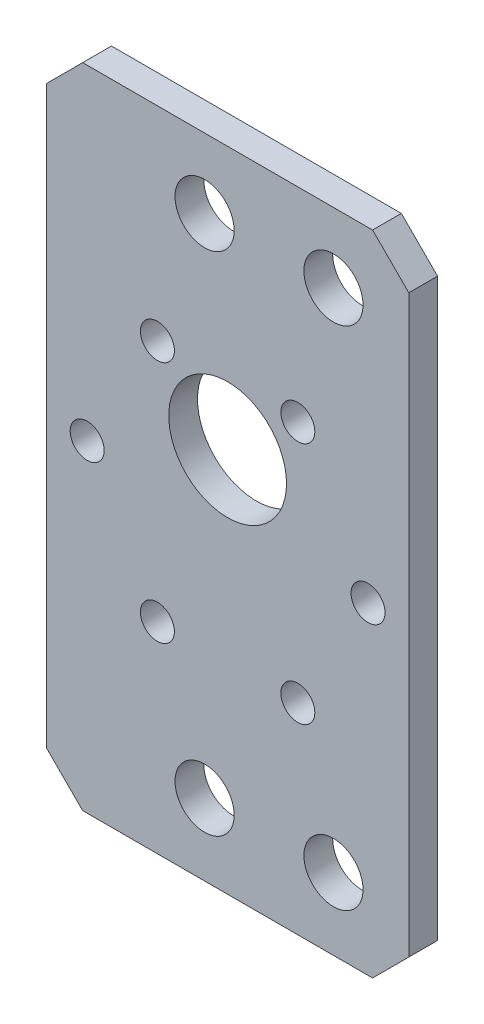
ISO-10303-21;
HEADER;
FILE_DESCRIPTION(('STEP AP214'),'2;1');
FILE_NAME('part.step','',(''),(''),'','','');
FILE_SCHEMA(('AUTOMOTIVE_DESIGN { 1 0 10303 214 1 1 1 1 }'));
ENDSEC;
DATA;
#1=APPLICATION_CONTEXT('core data for automotive mechanical design processes');
#2=APPLICATION_PROTOCOL_DEFINITION('international standard','automotive_design',2000,#1);
#3=PRODUCT_CONTEXT('',#1,'mechanical');
#4=PRODUCT('Part','Part','',(#3));
#5=PRODUCT_RELATED_PRODUCT_CATEGORY('part','',(#4));
#6=PRODUCT_DEFINITION_FORMATION('','',#4);
#7=PRODUCT_DEFINITION_CONTEXT('part definition',#1,'design');
#8=PRODUCT_DEFINITION('design','',#6,#7);
#9=PRODUCT_DEFINITION_SHAPE('','',#8);
#10=(LENGTH_UNIT() NAMED_UNIT(*) SI_UNIT(.MILLI.,.METRE.));
#11=(NAMED_UNIT(*) PLANE_ANGLE_UNIT() SI_UNIT($,.RADIAN.));
#12=(NAMED_UNIT(*) SI_UNIT($,.STERADIAN.) SOLID_ANGLE_UNIT());
#13=UNCERTAINTY_MEASURE_WITH_UNIT(LENGTH_MEASURE(1.E-05),#10,'distance_accuracy_value','');
#14=(GEOMETRIC_REPRESENTATION_CONTEXT(3) GLOBAL_UNCERTAINTY_ASSIGNED_CONTEXT((#13)) GLOBAL_UNIT_ASSIGNED_CONTEXT((#10,
#11,#12)) REPRESENTATION_CONTEXT('',''));
#15=CARTESIAN_POINT('',(0.,0.,0.));
#16=DIRECTION('',(0.,0.,1.));
#17=DIRECTION('',(1.,0.,0.));
#18=AXIS2_PLACEMENT_3D('',#15,#16,#17);
#19=CARTESIAN_POINT('',(0.,0.,3.175));
#20=DIRECTION('',(0.,0.,1.));
#21=DIRECTION('',(1.,0.,0.));
#22=AXIS2_PLACEMENT_3D('',#19,#20,#21);
#23=PLANE('',#22);
#24=CARTESIAN_POINT('',(11.684,21.299580023714,3.175));
#25=DIRECTION('',(0.,0.,-1.));
#26=DIRECTION('',(-1.,0.,0.));
#27=AXIS2_PLACEMENT_3D('',#24,#25,#26);
#28=CIRCLE('',#27,3.2639);
#29=CARTESIAN_POINT('',(8.42010000000002,21.299580023714,3.175));
#30=VERTEX_POINT('',#29);
#31=EDGE_CURVE('E241',#30,#30,#28,.T.);
#32=ORIENTED_EDGE('',*,*,#31,.T.);
#33=EDGE_LOOP('',(#32));
#34=FACE_BOUND('',#33,.T.);
#35=CARTESIAN_POINT('',(-2.53999999999999,21.299580023714,3.175));
#36=DIRECTION('',(0.,0.,-1.));
#37=DIRECTION('',(-1.,0.,0.));
#38=AXIS2_PLACEMENT_3D('',#35,#36,#37);
#39=CIRCLE('',#38,3.2639);
#40=CARTESIAN_POINT('',(-5.80389999999998,21.299580023714,3.175));
#41=VERTEX_POINT('',#40);
#42=EDGE_CURVE('E235',#41,#41,#39,.T.);
#43=ORIENTED_EDGE('',*,*,#42,.T.);
#44=EDGE_LOOP('',(#43));
#45=FACE_BOUND('',#44,.T.);
#46=CARTESIAN_POINT('',(11.684,-34.5804199762861,3.175));
#47=DIRECTION('',(0.,0.,-1.));
#48=DIRECTION('',(-1.,0.,0.));
#49=AXIS2_PLACEMENT_3D('',#46,#47,#48);
#50=CIRCLE('',#49,3.2639);
#51=CARTESIAN_POINT('',(8.42010000000002,-34.5804199762861,3.175));
#52=VERTEX_POINT('',#51);
#53=EDGE_CURVE('E229',#52,#52,#50,.T.);
#54=ORIENTED_EDGE('',*,*,#53,.T.);
#55=EDGE_LOOP('',(#54));
#56=FACE_BOUND('',#55,.T.);
#57=CARTESIAN_POINT('',(-2.53999999999999,-34.5804199762861,3.175));
#58=DIRECTION('',(0.,0.,-1.));
#59=DIRECTION('',(-1.,0.,0.));
#60=AXIS2_PLACEMENT_3D('',#57,#58,#59);
#61=CIRCLE('',#60,3.2639);
#62=CARTESIAN_POINT('',(-5.80389999999998,-34.5804199762861,3.175));
#63=VERTEX_POINT('',#62);
#64=EDGE_CURVE('E210',#63,#63,#61,.T.);
#65=ORIENTED_EDGE('',*,*,#64,.T.);
#66=EDGE_LOOP('',(#65));
#67=FACE_BOUND('',#66,.T.);
#68=CARTESIAN_POINT('',(-15.5,-6.89914345751769,3.175));
#69=DIRECTION('',(0.,0.,1.));
#70=DIRECTION('',(1.,0.,0.));
#71=AXIS2_PLACEMENT_3D('',#68,#69,#70);
#72=CIRCLE('',#71,1.875);
#73=CARTESIAN_POINT('',(-13.625,-6.89914345751769,3.175));
#74=VERTEX_POINT('',#73);
#75=EDGE_CURVE('E206',#74,#74,#72,.T.);
#76=ORIENTED_EDGE('',*,*,#75,.F.);
#77=EDGE_LOOP('',(#76));
#78=FACE_BOUND('',#77,.T.);
#79=CARTESIAN_POINT('',(-7.74999999999987,-20.3225372161766,3.175));
#80=DIRECTION('',(0.,0.,1.));
#81=DIRECTION('',(1.,0.,0.));
#82=AXIS2_PLACEMENT_3D('',#79,#80,#81);
#83=CIRCLE('',#82,1.875);
#84=CARTESIAN_POINT('',(-5.87499999999987,-20.3225372161766,3.175));
#85=VERTEX_POINT('',#84);
#86=EDGE_CURVE('E213',#85,#85,#83,.T.);
#87=ORIENTED_EDGE('',*,*,#86,.F.);
#88=EDGE_LOOP('',(#87));
#89=FACE_BOUND('',#88,.T.);
#90=CARTESIAN_POINT('',(7.75000000000016,-20.3225372161764,3.175));
#91=DIRECTION('',(0.,0.,1.));
#92=DIRECTION('',(1.,0.,0.));
#93=AXIS2_PLACEMENT_3D('',#90,#91,#92);
#94=CIRCLE('',#93,1.875);
#95=CARTESIAN_POINT('',(9.62500000000016,-20.3225372161764,3.175));
#96=VERTEX_POINT('',#95);
#97=EDGE_CURVE('E219',#96,#96,#94,.T.);
#98=ORIENTED_EDGE('',*,*,#97,.F.);
#99=EDGE_LOOP('',(#98));
#100=FACE_BOUND('',#99,.T.);
#101=CARTESIAN_POINT('',(15.5,-6.89914345751769,3.175));
#102=DIRECTION('',(0.,0.,1.));
#103=DIRECTION('',(1.,0.,0.));
#104=AXIS2_PLACEMENT_3D('',#101,#102,#103);
#105=CIRCLE('',#104,1.875);
#106=CARTESIAN_POINT('',(17.375,-6.89914345751769,3.175));
#107=VERTEX_POINT('',#106);
#108=EDGE_CURVE('E194',#107,#107,#105,.T.);
#109=ORIENTED_EDGE('',*,*,#108,.F.);
#110=EDGE_LOOP('',(#109));
#111=FACE_BOUND('',#110,.T.);
#112=CARTESIAN_POINT('',(7.74999999999997,6.52425030114113,3.175));
#113=DIRECTION('',(0.,0.,1.));
#114=DIRECTION('',(1.,0.,0.));
#115=AXIS2_PLACEMENT_3D('',#112,#113,#114);
#116=CIRCLE('',#115,1.875);
#117=CARTESIAN_POINT('',(9.62499999999996,6.52425030114113,3.175));
#118=VERTEX_POINT('',#117);
#119=EDGE_CURVE('E201',#118,#118,#116,.T.);
#120=ORIENTED_EDGE('',*,*,#119,.F.);
#121=EDGE_LOOP('',(#120));
#122=FACE_BOUND('',#121,.T.);
#123=CARTESIAN_POINT('',(-7.75000000000006,6.52425030114108,3.175));
#124=DIRECTION('',(0.,0.,1.));
#125=DIRECTION('',(1.,0.,0.));
#126=AXIS2_PLACEMENT_3D('',#123,#124,#125);
#127=CIRCLE('',#126,1.875);
#128=CARTESIAN_POINT('',(-5.87500000000006,6.52425030114108,3.175));
#129=VERTEX_POINT('',#128);
#130=EDGE_CURVE('E188',#129,#129,#127,.T.);
#131=ORIENTED_EDGE('',*,*,#130,.F.);
#132=EDGE_LOOP('',(#131));
#133=FACE_BOUND('',#132,.T.);
#134=DIRECTION('',(-1.,0.,0.));
#135=VECTOR('',#134,1.);
#136=CARTESIAN_POINT('',(-20.,29.,3.175));
#137=LINE('',#136,#135);
#138=CARTESIAN_POINT('',(16.,29.,3.175));
#139=VERTEX_POINT('',#138);
#140=CARTESIAN_POINT('',(-16.,29.,3.175));
#141=VERTEX_POINT('',#140);
#142=EDGE_CURVE('E138',#139,#141,#137,.T.);
#143=ORIENTED_EDGE('',*,*,#142,.T.);
#144=DIRECTION('',(0.707106781186549,0.707106781186546,0.));
#145=VECTOR('',#144,1.);
#146=CARTESIAN_POINT('',(-22.5,22.5,3.175));
#147=LINE('',#146,#145);
#148=CARTESIAN_POINT('',(-20.,25.,3.175));
#149=VERTEX_POINT('',#148);
#150=EDGE_CURVE('E156',#141,#149,#147,.F.);
#151=ORIENTED_EDGE('',*,*,#150,.T.);
#152=DIRECTION('',(0.,-1.,0.));
#153=VECTOR('',#152,1.);
#154=CARTESIAN_POINT('',(-20.,29.,3.175));
#155=LINE('',#154,#153);
#156=CARTESIAN_POINT('',(-20.,-38.5,3.175));
#157=VERTEX_POINT('',#156);
#158=EDGE_CURVE('E120',#149,#157,#155,.T.);
#159=ORIENTED_EDGE('',*,*,#158,.T.);
#160=DIRECTION('',(-0.707106781186546,0.707106781186549,0.));
#161=VECTOR('',#160,1.);
#162=CARTESIAN_POINT('',(-29.25,-29.2499999999999,3.175));
#163=LINE('',#162,#161);
#164=CARTESIAN_POINT('',(-16.,-42.5,3.175));
#165=VERTEX_POINT('',#164);
#166=EDGE_CURVE('E152',#157,#165,#163,.F.);
#167=ORIENTED_EDGE('',*,*,#166,.T.);
#168=DIRECTION('',(1.,0.,0.));
#169=VECTOR('',#168,1.);
#170=CARTESIAN_POINT('',(-20.,-42.5,3.175));
#171=LINE('',#170,#169);
#172=CARTESIAN_POINT('',(16.,-42.5,3.175));
#173=VERTEX_POINT('',#172);
#174=EDGE_CURVE('E165',#165,#173,#171,.T.);
#175=ORIENTED_EDGE('',*,*,#174,.T.);
#176=DIRECTION('',(-0.707106781186549,-0.707106781186546,0.));
#177=VECTOR('',#176,1.);
#178=CARTESIAN_POINT('',(29.25,-29.2500000000001,3.175));
#179=LINE('',#178,#177);
#180=CARTESIAN_POINT('',(20.,-38.5,3.175));
#181=VERTEX_POINT('',#180);
#182=EDGE_CURVE('E55',#173,#181,#179,.F.);
#183=ORIENTED_EDGE('',*,*,#182,.T.);
#184=DIRECTION('',(0.,1.,0.));
#185=VECTOR('',#184,1.);
#186=CARTESIAN_POINT('',(20.,29.,3.175));
#187=LINE('',#186,#185);
#188=CARTESIAN_POINT('',(20.,25.,3.175));
#189=VERTEX_POINT('',#188);
#190=EDGE_CURVE('E171',#181,#189,#187,.T.);
#191=ORIENTED_EDGE('',*,*,#190,.T.);
#192=DIRECTION('',(0.707106781186546,-0.707106781186549,0.));
#193=VECTOR('',#192,1.);
#194=CARTESIAN_POINT('',(22.5,22.5,3.175));
#195=LINE('',#194,#193);
#196=EDGE_CURVE('E154',#189,#139,#195,.F.);
#197=ORIENTED_EDGE('',*,*,#196,.T.);
#198=EDGE_LOOP('',(#143,#151,#159,#167,#175,#183,#191,#197));
#199=FACE_BOUND('',#198,.T.);
#200=CARTESIAN_POINT('',(0.,0.,3.175));
#201=DIRECTION('',(0.,0.,1.));
#202=DIRECTION('',(1.,0.,0.));
#203=AXIS2_PLACEMENT_3D('',#200,#201,#202);
#204=CIRCLE('',#203,6.5);
#205=CARTESIAN_POINT('',(6.5,0.,3.175));
#206=VERTEX_POINT('',#205);
#207=EDGE_CURVE('E129',#206,#206,#204,.T.);
#208=ORIENTED_EDGE('',*,*,#207,.F.);
#209=EDGE_LOOP('',(#208));
#210=FACE_BOUND('',#209,.T.);
#211=ADVANCED_FACE('F33',(#34,#45,#56,#67,#78,#89,#100,#111,#122,#133,#199,#210),#23,.T.);
#212=CARTESIAN_POINT('',(0.,0.,0.));
#213=DIRECTION('',(0.,0.,1.));
#214=DIRECTION('',(1.,0.,0.));
#215=AXIS2_PLACEMENT_3D('',#212,#213,#214);
#216=PLANE('',#215);
#217=CARTESIAN_POINT('',(11.684,21.299580023714,0.));
#218=DIRECTION('',(0.,0.,-1.));
#219=DIRECTION('',(-1.,0.,0.));
#220=AXIS2_PLACEMENT_3D('',#217,#218,#219);
#221=CIRCLE('',#220,3.2639);
#222=CARTESIAN_POINT('',(8.42010000000002,21.299580023714,0.));
#223=VERTEX_POINT('',#222);
#224=EDGE_CURVE('E244',#223,#223,#221,.T.);
#225=ORIENTED_EDGE('',*,*,#224,.F.);
#226=EDGE_LOOP('',(#225));
#227=FACE_BOUND('',#226,.T.);
#228=CARTESIAN_POINT('',(-2.53999999999999,21.299580023714,0.));
#229=DIRECTION('',(0.,0.,-1.));
#230=DIRECTION('',(-1.,0.,0.));
#231=AXIS2_PLACEMENT_3D('',#228,#229,#230);
#232=CIRCLE('',#231,3.2639);
#233=CARTESIAN_POINT('',(-5.80389999999999,21.299580023714,0.));
#234=VERTEX_POINT('',#233);
#235=EDGE_CURVE('E238',#234,#234,#232,.T.);
#236=ORIENTED_EDGE('',*,*,#235,.F.);
#237=EDGE_LOOP('',(#236));
#238=FACE_BOUND('',#237,.T.);
#239=CARTESIAN_POINT('',(11.684,-34.5804199762861,0.));
#240=DIRECTION('',(0.,0.,-1.));
#241=DIRECTION('',(-1.,0.,0.));
#242=AXIS2_PLACEMENT_3D('',#239,#240,#241);
#243=CIRCLE('',#242,3.2639);
#244=CARTESIAN_POINT('',(8.42010000000002,-34.5804199762861,0.));
#245=VERTEX_POINT('',#244);
#246=EDGE_CURVE('E232',#245,#245,#243,.T.);
#247=ORIENTED_EDGE('',*,*,#246,.F.);
#248=EDGE_LOOP('',(#247));
#249=FACE_BOUND('',#248,.T.);
#250=CARTESIAN_POINT('',(-2.53999999999999,-34.5804199762861,0.));
#251=DIRECTION('',(0.,0.,-1.));
#252=DIRECTION('',(-1.,0.,0.));
#253=AXIS2_PLACEMENT_3D('',#250,#251,#252);
#254=CIRCLE('',#253,3.2639);
#255=CARTESIAN_POINT('',(-5.80389999999999,-34.5804199762861,0.));
#256=VERTEX_POINT('',#255);
#257=EDGE_CURVE('E226',#256,#256,#254,.T.);
#258=ORIENTED_EDGE('',*,*,#257,.F.);
#259=EDGE_LOOP('',(#258));
#260=FACE_BOUND('',#259,.T.);
#261=CARTESIAN_POINT('',(-15.5,-6.89914345751769,0.));
#262=DIRECTION('',(0.,0.,1.));
#263=DIRECTION('',(1.,0.,0.));
#264=AXIS2_PLACEMENT_3D('',#261,#262,#263);
#265=CIRCLE('',#264,1.875);
#266=CARTESIAN_POINT('',(-13.625,-6.89914345751769,0.));
#267=VERTEX_POINT('',#266);
#268=EDGE_CURVE('E209',#267,#267,#265,.T.);
#269=ORIENTED_EDGE('',*,*,#268,.T.);
#270=EDGE_LOOP('',(#269));
#271=FACE_BOUND('',#270,.T.);
#272=CARTESIAN_POINT('',(-7.74999999999987,-20.3225372161766,0.));
#273=DIRECTION('',(0.,0.,1.));
#274=DIRECTION('',(1.,0.,0.));
#275=AXIS2_PLACEMENT_3D('',#272,#273,#274);
#276=CIRCLE('',#275,1.875);
#277=CARTESIAN_POINT('',(-5.87499999999987,-20.3225372161766,0.));
#278=VERTEX_POINT('',#277);
#279=EDGE_CURVE('E216',#278,#278,#276,.T.);
#280=ORIENTED_EDGE('',*,*,#279,.T.);
#281=EDGE_LOOP('',(#280));
#282=FACE_BOUND('',#281,.T.);
#283=CARTESIAN_POINT('',(7.75000000000016,-20.3225372161764,0.));
#284=DIRECTION('',(0.,0.,1.));
#285=DIRECTION('',(1.,0.,0.));
#286=AXIS2_PLACEMENT_3D('',#283,#284,#285);
#287=CIRCLE('',#286,1.875);
#288=CARTESIAN_POINT('',(9.62500000000016,-20.3225372161764,0.));
#289=VERTEX_POINT('',#288);
#290=EDGE_CURVE('E198',#289,#289,#287,.T.);
#291=ORIENTED_EDGE('',*,*,#290,.T.);
#292=EDGE_LOOP('',(#291));
#293=FACE_BOUND('',#292,.T.);
#294=CARTESIAN_POINT('',(15.5,-6.89914345751769,0.));
#295=DIRECTION('',(0.,0.,1.));
#296=DIRECTION('',(1.,0.,0.));
#297=AXIS2_PLACEMENT_3D('',#294,#295,#296);
#298=CIRCLE('',#297,1.875);
#299=CARTESIAN_POINT('',(17.375,-6.89914345751769,0.));
#300=VERTEX_POINT('',#299);
#301=EDGE_CURVE('E197',#300,#300,#298,.T.);
#302=ORIENTED_EDGE('',*,*,#301,.T.);
#303=EDGE_LOOP('',(#302));
#304=FACE_BOUND('',#303,.T.);
#305=CARTESIAN_POINT('',(7.74999999999997,6.52425030114113,0.));
#306=DIRECTION('',(0.,0.,1.));
#307=DIRECTION('',(1.,0.,0.));
#308=AXIS2_PLACEMENT_3D('',#305,#306,#307);
#309=CIRCLE('',#308,1.875);
#310=CARTESIAN_POINT('',(9.62499999999996,6.52425030114113,0.));
#311=VERTEX_POINT('',#310);
#312=EDGE_CURVE('E191',#311,#311,#309,.T.);
#313=ORIENTED_EDGE('',*,*,#312,.T.);
#314=EDGE_LOOP('',(#313));
#315=FACE_BOUND('',#314,.T.);
#316=CARTESIAN_POINT('',(-7.75000000000006,6.52425030114108,0.));
#317=DIRECTION('',(0.,0.,1.));
#318=DIRECTION('',(1.,0.,0.));
#319=AXIS2_PLACEMENT_3D('',#316,#317,#318);
#320=CIRCLE('',#319,1.875);
#321=CARTESIAN_POINT('',(-5.87500000000006,6.52425030114108,0.));
#322=VERTEX_POINT('',#321);
#323=EDGE_CURVE('E186',#322,#322,#320,.T.);
#324=ORIENTED_EDGE('',*,*,#323,.T.);
#325=EDGE_LOOP('',(#324));
#326=FACE_BOUND('',#325,.T.);
#327=DIRECTION('',(0.,-1.,0.));
#328=VECTOR('',#327,1.);
#329=CARTESIAN_POINT('',(-20.,29.,0.));
#330=LINE('',#329,#328);
#331=CARTESIAN_POINT('',(-20.,25.,0.));
#332=VERTEX_POINT('',#331);
#333=CARTESIAN_POINT('',(-20.,-38.5,0.));
#334=VERTEX_POINT('',#333);
#335=EDGE_CURVE('E117',#332,#334,#330,.T.);
#336=ORIENTED_EDGE('',*,*,#335,.F.);
#337=DIRECTION('',(-0.707106781186549,-0.707106781186546,0.));
#338=VECTOR('',#337,1.);
#339=CARTESIAN_POINT('',(-20.,25.,0.));
#340=LINE('',#339,#338);
#341=CARTESIAN_POINT('',(-16.,29.,0.));
#342=VERTEX_POINT('',#341);
#343=EDGE_CURVE('E100',#332,#342,#340,.F.);
#344=ORIENTED_EDGE('',*,*,#343,.T.);
#345=DIRECTION('',(-1.,0.,0.));
#346=VECTOR('',#345,1.);
#347=CARTESIAN_POINT('',(-20.,29.,0.));
#348=LINE('',#347,#346);
#349=CARTESIAN_POINT('',(16.,29.,0.));
#350=VERTEX_POINT('',#349);
#351=EDGE_CURVE('E142',#350,#342,#348,.T.);
#352=ORIENTED_EDGE('',*,*,#351,.F.);
#353=DIRECTION('',(-0.707106781186546,0.707106781186549,0.));
#354=VECTOR('',#353,1.);
#355=CARTESIAN_POINT('',(16.,29.,0.));
#356=LINE('',#355,#354);
#357=CARTESIAN_POINT('',(20.,25.,0.));
#358=VERTEX_POINT('',#357);
#359=EDGE_CURVE('E111',#350,#358,#356,.F.);
#360=ORIENTED_EDGE('',*,*,#359,.T.);
#361=DIRECTION('',(0.,1.,0.));
#362=VECTOR('',#361,1.);
#363=CARTESIAN_POINT('',(20.,29.,0.));
#364=LINE('',#363,#362);
#365=CARTESIAN_POINT('',(20.,-38.5,0.));
#366=VERTEX_POINT('',#365);
#367=EDGE_CURVE('E132',#366,#358,#364,.T.);
#368=ORIENTED_EDGE('',*,*,#367,.F.);
#369=DIRECTION('',(0.707106781186549,0.707106781186546,0.));
#370=VECTOR('',#369,1.);
#371=CARTESIAN_POINT('',(20.,-38.5,0.));
#372=LINE('',#371,#370);
#373=CARTESIAN_POINT('',(16.,-42.5,0.));
#374=VERTEX_POINT('',#373);
#375=EDGE_CURVE('E121',#366,#374,#372,.F.);
#376=ORIENTED_EDGE('',*,*,#375,.T.);
#377=DIRECTION('',(1.,0.,0.));
#378=VECTOR('',#377,1.);
#379=CARTESIAN_POINT('',(-20.,-42.5,0.));
#380=LINE('',#379,#378);
#381=CARTESIAN_POINT('',(-16.,-42.5,0.));
#382=VERTEX_POINT('',#381);
#383=EDGE_CURVE('E128',#382,#374,#380,.T.);
#384=ORIENTED_EDGE('',*,*,#383,.F.);
#385=DIRECTION('',(0.707106781186546,-0.707106781186549,0.));
#386=VECTOR('',#385,1.);
#387=CARTESIAN_POINT('',(-16.,-42.5,0.));
#388=LINE('',#387,#386);
#389=EDGE_CURVE('E127',#382,#334,#388,.F.);
#390=ORIENTED_EDGE('',*,*,#389,.T.);
#391=EDGE_LOOP('',(#336,#344,#352,#360,#368,#376,#384,#390));
#392=FACE_BOUND('',#391,.T.);
#393=CARTESIAN_POINT('',(0.,0.,0.));
#394=DIRECTION('',(0.,0.,1.));
#395=DIRECTION('',(1.,0.,0.));
#396=AXIS2_PLACEMENT_3D('',#393,#394,#395);
#397=CIRCLE('',#396,6.5);
#398=CARTESIAN_POINT('',(6.5,0.,0.));
#399=VERTEX_POINT('',#398);
#400=EDGE_CURVE('E135',#399,#399,#397,.T.);
#401=ORIENTED_EDGE('',*,*,#400,.T.);
#402=EDGE_LOOP('',(#401));
#403=FACE_BOUND('',#402,.T.);
#404=ADVANCED_FACE('F124',(#227,#238,#249,#260,#271,#282,#293,#304,#315,#326,#392,#403),#216,.F.);
#405=CARTESIAN_POINT('',(-20.,29.,3.175));
#406=DIRECTION('',(1.,0.,0.));
#407=DIRECTION('',(0.,1.,0.));
#408=AXIS2_PLACEMENT_3D('',#405,#406,#407);
#409=PLANE('',#408);
#410=ORIENTED_EDGE('',*,*,#158,.F.);
#411=DIRECTION('',(0.,0.,-1.));
#412=VECTOR('',#411,1.);
#413=CARTESIAN_POINT('',(-20.,25.,3.175));
#414=LINE('',#413,#412);
#415=EDGE_CURVE('E104',#149,#332,#414,.T.);
#416=ORIENTED_EDGE('',*,*,#415,.T.);
#417=ORIENTED_EDGE('',*,*,#335,.T.);
#418=DIRECTION('',(0.,0.,1.));
#419=VECTOR('',#418,1.);
#420=CARTESIAN_POINT('',(-20.,-38.5,3.175));
#421=LINE('',#420,#419);
#422=EDGE_CURVE('E122',#334,#157,#421,.T.);
#423=ORIENTED_EDGE('',*,*,#422,.T.);
#424=EDGE_LOOP('',(#410,#416,#417,#423));
#425=FACE_BOUND('',#424,.T.);
#426=ADVANCED_FACE('F116',(#425),#409,.F.);
#427=CARTESIAN_POINT('',(-20.,-42.5,3.175));
#428=DIRECTION('',(0.,1.,0.));
#429=DIRECTION('',(0.,0.,1.));
#430=AXIS2_PLACEMENT_3D('',#427,#428,#429);
#431=PLANE('',#430);
#432=ORIENTED_EDGE('',*,*,#174,.F.);
#433=DIRECTION('',(0.,0.,-1.));
#434=VECTOR('',#433,1.);
#435=CARTESIAN_POINT('',(-16.,-42.5,3.175));
#436=LINE('',#435,#434);
#437=EDGE_CURVE('E11',#165,#382,#436,.T.);
#438=ORIENTED_EDGE('',*,*,#437,.T.);
#439=ORIENTED_EDGE('',*,*,#383,.T.);
#440=DIRECTION('',(0.,0.,1.));
#441=VECTOR('',#440,1.);
#442=CARTESIAN_POINT('',(16.,-42.5,3.175));
#443=LINE('',#442,#441);
#444=EDGE_CURVE('E41',#374,#173,#443,.T.);
#445=ORIENTED_EDGE('',*,*,#444,.T.);
#446=EDGE_LOOP('',(#432,#438,#439,#445));
#447=FACE_BOUND('',#446,.T.);
#448=ADVANCED_FACE('F164',(#447),#431,.F.);
#449=CARTESIAN_POINT('',(20.,29.,3.175));
#450=DIRECTION('',(-1.,0.,0.));
#451=DIRECTION('',(0.,-1.,0.));
#452=AXIS2_PLACEMENT_3D('',#449,#450,#451);
#453=PLANE('',#452);
#454=ORIENTED_EDGE('',*,*,#367,.T.);
#455=DIRECTION('',(0.,0.,1.));
#456=VECTOR('',#455,1.);
#457=CARTESIAN_POINT('',(20.,25.,3.175));
#458=LINE('',#457,#456);
#459=EDGE_CURVE('E48',#358,#189,#458,.T.);
#460=ORIENTED_EDGE('',*,*,#459,.T.);
#461=ORIENTED_EDGE('',*,*,#190,.F.);
#462=DIRECTION('',(0.,0.,-1.));
#463=VECTOR('',#462,1.);
#464=CARTESIAN_POINT('',(20.,-38.5,3.175));
#465=LINE('',#464,#463);
#466=EDGE_CURVE('E158',#181,#366,#465,.T.);
#467=ORIENTED_EDGE('',*,*,#466,.T.);
#468=EDGE_LOOP('',(#454,#460,#461,#467));
#469=FACE_BOUND('',#468,.T.);
#470=ADVANCED_FACE('F175',(#469),#453,.F.);
#471=CARTESIAN_POINT('',(-20.,29.,3.175));
#472=DIRECTION('',(0.,-1.,0.));
#473=DIRECTION('',(0.,0.,-1.));
#474=AXIS2_PLACEMENT_3D('',#471,#472,#473);
#475=PLANE('',#474);
#476=ORIENTED_EDGE('',*,*,#351,.T.);
#477=DIRECTION('',(0.,0.,1.));
#478=VECTOR('',#477,1.);
#479=CARTESIAN_POINT('',(-16.,29.,3.175));
#480=LINE('',#479,#478);
#481=EDGE_CURVE('E105',#342,#141,#480,.T.);
#482=ORIENTED_EDGE('',*,*,#481,.T.);
#483=ORIENTED_EDGE('',*,*,#142,.F.);
#484=DIRECTION('',(0.,0.,-1.));
#485=VECTOR('',#484,1.);
#486=CARTESIAN_POINT('',(16.,29.,3.175));
#487=LINE('',#486,#485);
#488=EDGE_CURVE('E110',#139,#350,#487,.T.);
#489=ORIENTED_EDGE('',*,*,#488,.T.);
#490=EDGE_LOOP('',(#476,#482,#483,#489));
#491=FACE_BOUND('',#490,.T.);
#492=ADVANCED_FACE('F182',(#491),#475,.F.);
#493=CARTESIAN_POINT('',(0.,0.,3.175));
#494=DIRECTION('',(0.,0.,-1.));
#495=DIRECTION('',(-1.,0.,0.));
#496=AXIS2_PLACEMENT_3D('',#493,#494,#495);
#497=CYLINDRICAL_SURFACE('',#496,6.5);
#498=ORIENTED_EDGE('',*,*,#207,.T.);
#499=EDGE_LOOP('',(#498));
#500=FACE_BOUND('',#499,.T.);
#501=ORIENTED_EDGE('',*,*,#400,.F.);
#502=EDGE_LOOP('',(#501));
#503=FACE_BOUND('',#502,.T.);
#504=ADVANCED_FACE('F285',(#500,#503),#497,.F.);
#505=CARTESIAN_POINT('',(-20.,25.,3.175));
#506=DIRECTION('',(0.707106781186546,-0.707106781186549,0.));
#507=DIRECTION('',(0.,0.,-1.));
#508=AXIS2_PLACEMENT_3D('',#505,#506,#507);
#509=PLANE('',#508);
#510=ORIENTED_EDGE('',*,*,#150,.F.);
#511=ORIENTED_EDGE('',*,*,#481,.F.);
#512=ORIENTED_EDGE('',*,*,#343,.F.);
#513=ORIENTED_EDGE('',*,*,#415,.F.);
#514=EDGE_LOOP('',(#510,#511,#512,#513));
#515=FACE_BOUND('',#514,.T.);
#516=ADVANCED_FACE('F103',(#515),#509,.F.);
#517=CARTESIAN_POINT('',(16.,29.,3.175));
#518=DIRECTION('',(-0.707106781186549,-0.707106781186546,0.));
#519=DIRECTION('',(0.,0.,-1.));
#520=AXIS2_PLACEMENT_3D('',#517,#518,#519);
#521=PLANE('',#520);
#522=ORIENTED_EDGE('',*,*,#196,.F.);
#523=ORIENTED_EDGE('',*,*,#459,.F.);
#524=ORIENTED_EDGE('',*,*,#359,.F.);
#525=ORIENTED_EDGE('',*,*,#488,.F.);
#526=EDGE_LOOP('',(#522,#523,#524,#525));
#527=FACE_BOUND('',#526,.T.);
#528=ADVANCED_FACE('F179',(#527),#521,.F.);
#529=CARTESIAN_POINT('',(-16.,-42.5,3.175));
#530=DIRECTION('',(0.707106781186549,0.707106781186546,0.));
#531=DIRECTION('',(0.,0.,-1.));
#532=AXIS2_PLACEMENT_3D('',#529,#530,#531);
#533=PLANE('',#532);
#534=ORIENTED_EDGE('',*,*,#166,.F.);
#535=ORIENTED_EDGE('',*,*,#422,.F.);
#536=ORIENTED_EDGE('',*,*,#389,.F.);
#537=ORIENTED_EDGE('',*,*,#437,.F.);
#538=EDGE_LOOP('',(#534,#535,#536,#537));
#539=FACE_BOUND('',#538,.T.);
#540=ADVANCED_FACE('F298',(#539),#533,.F.);
#541=CARTESIAN_POINT('',(20.,-38.5,3.175));
#542=DIRECTION('',(-0.707106781186546,0.707106781186549,0.));
#543=DIRECTION('',(0.,0.,-1.));
#544=AXIS2_PLACEMENT_3D('',#541,#542,#543);
#545=PLANE('',#544);
#546=ORIENTED_EDGE('',*,*,#182,.F.);
#547=ORIENTED_EDGE('',*,*,#444,.F.);
#548=ORIENTED_EDGE('',*,*,#375,.F.);
#549=ORIENTED_EDGE('',*,*,#466,.F.);
#550=EDGE_LOOP('',(#546,#547,#548,#549));
#551=FACE_BOUND('',#550,.T.);
#552=ADVANCED_FACE('F35',(#551),#545,.F.);
#553=CARTESIAN_POINT('',(-7.75000000000006,6.52425030114108,0.));
#554=DIRECTION('',(0.,0.,1.));
#555=DIRECTION('',(1.,0.,0.));
#556=AXIS2_PLACEMENT_3D('',#553,#554,#555);
#557=CYLINDRICAL_SURFACE('',#556,1.875);
#558=ORIENTED_EDGE('',*,*,#323,.F.);
#559=EDGE_LOOP('',(#558));
#560=FACE_BOUND('',#559,.T.);
#561=ORIENTED_EDGE('',*,*,#130,.T.);
#562=EDGE_LOOP('',(#561));
#563=FACE_BOUND('',#562,.T.);
#564=ADVANCED_FACE('F271',(#560,#563),#557,.F.);
#565=CARTESIAN_POINT('',(7.74999999999997,6.52425030114113,0.));
#566=DIRECTION('',(0.,0.,1.));
#567=DIRECTION('',(1.,0.,0.));
#568=AXIS2_PLACEMENT_3D('',#565,#566,#567);
#569=CYLINDRICAL_SURFACE('',#568,1.875);
#570=ORIENTED_EDGE('',*,*,#312,.F.);
#571=EDGE_LOOP('',(#570));
#572=FACE_BOUND('',#571,.T.);
#573=ORIENTED_EDGE('',*,*,#119,.T.);
#574=EDGE_LOOP('',(#573));
#575=FACE_BOUND('',#574,.T.);
#576=ADVANCED_FACE('F274',(#572,#575),#569,.F.);
#577=CARTESIAN_POINT('',(15.5,-6.89914345751769,0.));
#578=DIRECTION('',(0.,0.,1.));
#579=DIRECTION('',(1.,0.,0.));
#580=AXIS2_PLACEMENT_3D('',#577,#578,#579);
#581=CYLINDRICAL_SURFACE('',#580,1.875);
#582=ORIENTED_EDGE('',*,*,#301,.F.);
#583=EDGE_LOOP('',(#582));
#584=FACE_BOUND('',#583,.T.);
#585=ORIENTED_EDGE('',*,*,#108,.T.);
#586=EDGE_LOOP('',(#585));
#587=FACE_BOUND('',#586,.T.);
#588=ADVANCED_FACE('F316',(#584,#587),#581,.F.);
#589=CARTESIAN_POINT('',(7.75000000000016,-20.3225372161764,0.));
#590=DIRECTION('',(0.,0.,1.));
#591=DIRECTION('',(1.,0.,0.));
#592=AXIS2_PLACEMENT_3D('',#589,#590,#591);
#593=CYLINDRICAL_SURFACE('',#592,1.875);
#594=ORIENTED_EDGE('',*,*,#290,.F.);
#595=EDGE_LOOP('',(#594));
#596=FACE_BOUND('',#595,.T.);
#597=ORIENTED_EDGE('',*,*,#97,.T.);
#598=EDGE_LOOP('',(#597));
#599=FACE_BOUND('',#598,.T.);
#600=ADVANCED_FACE('F324',(#596,#599),#593,.F.);
#601=CARTESIAN_POINT('',(-7.74999999999987,-20.3225372161766,0.));
#602=DIRECTION('',(0.,0.,1.));
#603=DIRECTION('',(1.,0.,0.));
#604=AXIS2_PLACEMENT_3D('',#601,#602,#603);
#605=CYLINDRICAL_SURFACE('',#604,1.875);
#606=ORIENTED_EDGE('',*,*,#279,.F.);
#607=EDGE_LOOP('',(#606));
#608=FACE_BOUND('',#607,.T.);
#609=ORIENTED_EDGE('',*,*,#86,.T.);
#610=EDGE_LOOP('',(#609));
#611=FACE_BOUND('',#610,.T.);
#612=ADVANCED_FACE('F332',(#608,#611),#605,.F.);
#613=CARTESIAN_POINT('',(-15.5,-6.89914345751769,0.));
#614=DIRECTION('',(0.,0.,1.));
#615=DIRECTION('',(1.,0.,0.));
#616=AXIS2_PLACEMENT_3D('',#613,#614,#615);
#617=CYLINDRICAL_SURFACE('',#616,1.875);
#618=ORIENTED_EDGE('',*,*,#268,.F.);
#619=EDGE_LOOP('',(#618));
#620=FACE_BOUND('',#619,.T.);
#621=ORIENTED_EDGE('',*,*,#75,.T.);
#622=EDGE_LOOP('',(#621));
#623=FACE_BOUND('',#622,.T.);
#624=ADVANCED_FACE('F340',(#620,#623),#617,.F.);
#625=CARTESIAN_POINT('',(-2.53999999999999,-34.5804199762861,0.));
#626=DIRECTION('',(0.,0.,-1.));
#627=DIRECTION('',(-1.,0.,0.));
#628=AXIS2_PLACEMENT_3D('',#625,#626,#627);
#629=CYLINDRICAL_SURFACE('',#628,3.2639);
#630=ORIENTED_EDGE('',*,*,#64,.F.);
#631=EDGE_LOOP('',(#630));
#632=FACE_BOUND('',#631,.T.);
#633=ORIENTED_EDGE('',*,*,#257,.T.);
#634=EDGE_LOOP('',(#633));
#635=FACE_BOUND('',#634,.T.);
#636=ADVANCED_FACE('F348',(#632,#635),#629,.F.);
#637=CARTESIAN_POINT('',(11.684,-34.5804199762861,0.));
#638=DIRECTION('',(0.,0.,-1.));
#639=DIRECTION('',(-1.,0.,0.));
#640=AXIS2_PLACEMENT_3D('',#637,#638,#639);
#641=CYLINDRICAL_SURFACE('',#640,3.2639);
#642=ORIENTED_EDGE('',*,*,#53,.F.);
#643=EDGE_LOOP('',(#642));
#644=FACE_BOUND('',#643,.T.);
#645=ORIENTED_EDGE('',*,*,#246,.T.);
#646=EDGE_LOOP('',(#645));
#647=FACE_BOUND('',#646,.T.);
#648=ADVANCED_FACE('F356',(#644,#647),#641,.F.);
#649=CARTESIAN_POINT('',(-2.53999999999999,21.299580023714,0.));
#650=DIRECTION('',(0.,0.,-1.));
#651=DIRECTION('',(-1.,0.,0.));
#652=AXIS2_PLACEMENT_3D('',#649,#650,#651);
#653=CYLINDRICAL_SURFACE('',#652,3.2639);
#654=ORIENTED_EDGE('',*,*,#42,.F.);
#655=EDGE_LOOP('',(#654));
#656=FACE_BOUND('',#655,.T.);
#657=ORIENTED_EDGE('',*,*,#235,.T.);
#658=EDGE_LOOP('',(#657));
#659=FACE_BOUND('',#658,.T.);
#660=ADVANCED_FACE('F365',(#656,#659),#653,.F.);
#661=CARTESIAN_POINT('',(11.684,21.299580023714,0.));
#662=DIRECTION('',(0.,0.,-1.));
#663=DIRECTION('',(-1.,0.,0.));
#664=AXIS2_PLACEMENT_3D('',#661,#662,#663);
#665=CYLINDRICAL_SURFACE('',#664,3.2639);
#666=ORIENTED_EDGE('',*,*,#31,.F.);
#667=EDGE_LOOP('',(#666));
#668=FACE_BOUND('',#667,.T.);
#669=ORIENTED_EDGE('',*,*,#224,.T.);
#670=EDGE_LOOP('',(#669));
#671=FACE_BOUND('',#670,.T.);
#672=ADVANCED_FACE('F248',(#668,#671),#665,.F.);
#673=CLOSED_SHELL('',(#211,#404,#426,#448,#470,#492,#504,#516,#528,#540,#552,#564,#576,#588,
#600,#612,#624,#636,#648,#660,#672));
#674=MANIFOLD_SOLID_BREP('B2',#673);
#675=ADVANCED_BREP_SHAPE_REPRESENTATION('',(#18,#674),#14);
#676=SHAPE_DEFINITION_REPRESENTATION(#9,#675);
ENDSEC;
END-ISO-10303-21;
